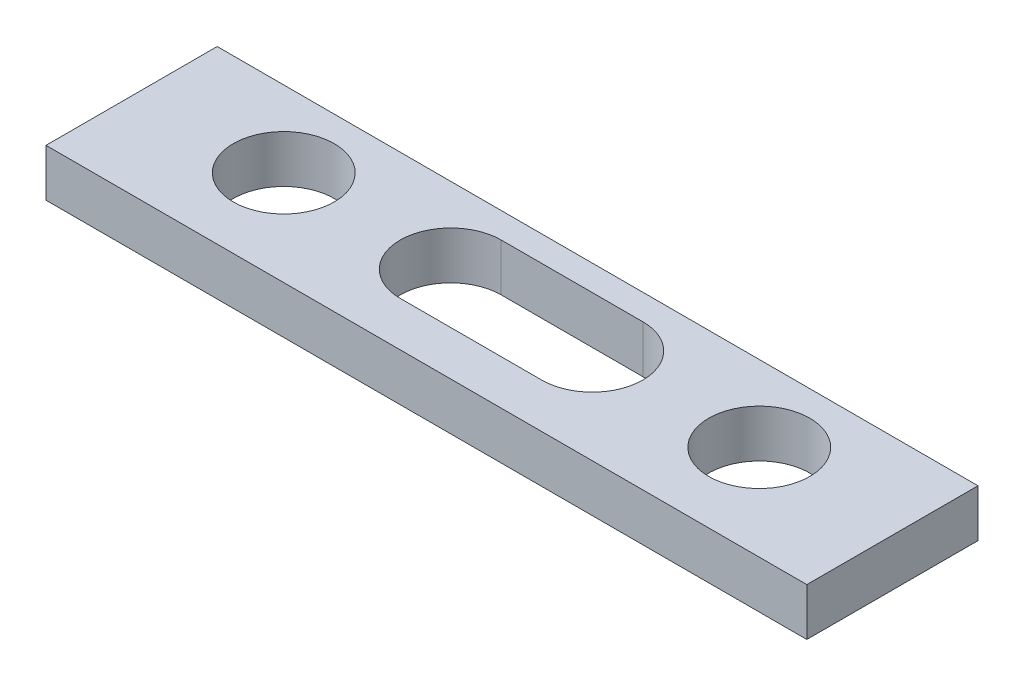
ISO-10303-21;
HEADER;
FILE_DESCRIPTION(('STEP AP214'),'2;1');
FILE_NAME('part.step','',(''),(''),'','','');
FILE_SCHEMA(('AUTOMOTIVE_DESIGN { 1 0 10303 214 1 1 1 1 }'));
ENDSEC;
DATA;
#1=APPLICATION_CONTEXT('core data for automotive mechanical design processes');
#2=APPLICATION_PROTOCOL_DEFINITION('international standard','automotive_design',2000,#1);
#3=PRODUCT_CONTEXT('',#1,'mechanical');
#4=PRODUCT('Part','Part','',(#3));
#5=PRODUCT_RELATED_PRODUCT_CATEGORY('part','',(#4));
#6=PRODUCT_DEFINITION_FORMATION('','',#4);
#7=PRODUCT_DEFINITION_CONTEXT('part definition',#1,'design');
#8=PRODUCT_DEFINITION('design','',#6,#7);
#9=PRODUCT_DEFINITION_SHAPE('','',#8);
#10=(LENGTH_UNIT() NAMED_UNIT(*) SI_UNIT(.MILLI.,.METRE.));
#11=(NAMED_UNIT(*) PLANE_ANGLE_UNIT() SI_UNIT($,.RADIAN.));
#12=(NAMED_UNIT(*) SI_UNIT($,.STERADIAN.) SOLID_ANGLE_UNIT());
#13=UNCERTAINTY_MEASURE_WITH_UNIT(LENGTH_MEASURE(1.E-05),#10,'distance_accuracy_value','');
#14=(GEOMETRIC_REPRESENTATION_CONTEXT(3) GLOBAL_UNCERTAINTY_ASSIGNED_CONTEXT((#13)) GLOBAL_UNIT_ASSIGNED_CONTEXT((#10,
#11,#12)) REPRESENTATION_CONTEXT('',''));
#15=CARTESIAN_POINT('',(0.,0.,0.));
#16=DIRECTION('',(0.,0.,1.));
#17=DIRECTION('',(1.,0.,0.));
#18=AXIS2_PLACEMENT_3D('',#15,#16,#17);
#19=CARTESIAN_POINT('',(50.8,-3.175,-11.43));
#20=DIRECTION('',(0.,0.,1.));
#21=DIRECTION('',(1.,0.,0.));
#22=AXIS2_PLACEMENT_3D('',#19,#20,#21);
#23=PLANE('',#22);
#24=DIRECTION('',(-1.,0.,0.));
#25=VECTOR('',#24,1.);
#26=CARTESIAN_POINT('',(50.8,-3.175,-11.43));
#27=LINE('',#26,#25);
#28=CARTESIAN_POINT('',(50.8,-3.175,-11.43));
#29=VERTEX_POINT('',#28);
#30=CARTESIAN_POINT('',(-50.8,-3.175,-11.43));
#31=VERTEX_POINT('',#30);
#32=EDGE_CURVE('E177',#29,#31,#27,.T.);
#33=ORIENTED_EDGE('',*,*,#32,.T.);
#34=DIRECTION('',(0.,1.,0.));
#35=VECTOR('',#34,1.);
#36=CARTESIAN_POINT('',(-50.8,-3.175,-11.43));
#37=LINE('',#36,#35);
#38=CARTESIAN_POINT('',(-50.8,3.175,-11.43));
#39=VERTEX_POINT('',#38);
#40=EDGE_CURVE('E156',#31,#39,#37,.T.);
#41=ORIENTED_EDGE('',*,*,#40,.T.);
#42=DIRECTION('',(-1.,0.,0.));
#43=VECTOR('',#42,1.);
#44=CARTESIAN_POINT('',(50.8,3.175,-11.43));
#45=LINE('',#44,#43);
#46=CARTESIAN_POINT('',(50.8,3.175,-11.43));
#47=VERTEX_POINT('',#46);
#48=EDGE_CURVE('E13',#47,#39,#45,.T.);
#49=ORIENTED_EDGE('',*,*,#48,.F.);
#50=DIRECTION('',(0.,1.,0.));
#51=VECTOR('',#50,1.);
#52=CARTESIAN_POINT('',(50.8,-3.175,-11.43));
#53=LINE('',#52,#51);
#54=EDGE_CURVE('E168',#29,#47,#53,.T.);
#55=ORIENTED_EDGE('',*,*,#54,.F.);
#56=EDGE_LOOP('',(#33,#41,#49,#55));
#57=FACE_BOUND('',#56,.T.);
#58=ADVANCED_FACE('F45',(#57),#23,.F.);
#59=CARTESIAN_POINT('',(50.8,3.175,11.43));
#60=DIRECTION('',(0.,-1.,0.));
#61=DIRECTION('',(0.,0.,-1.));
#62=AXIS2_PLACEMENT_3D('',#59,#60,#61);
#63=PLANE('',#62);
#64=DIRECTION('',(-1.,0.,0.));
#65=VECTOR('',#64,1.);
#66=CARTESIAN_POINT('',(9.45258988360647,3.175,-8.01687499999999));
#67=LINE('',#66,#65);
#68=CARTESIAN_POINT('',(9.45258988360648,3.175,-8.016875));
#69=VERTEX_POINT('',#68);
#70=CARTESIAN_POINT('',(-9.452589807,3.175,-8.01687499999999));
#71=VERTEX_POINT('',#70);
#72=EDGE_CURVE('E135',#69,#71,#67,.T.);
#73=ORIENTED_EDGE('',*,*,#72,.F.);
#74=CARTESIAN_POINT('',(9.45258988360647,3.175,-1.27));
#75=DIRECTION('',(0.,1.,0.));
#76=DIRECTION('',(0.,0.,1.));
#77=AXIS2_PLACEMENT_3D('',#74,#75,#76);
#78=CIRCLE('',#77,6.74687499999999);
#79=CARTESIAN_POINT('',(9.45258988360647,3.175,5.47687499999999));
#80=VERTEX_POINT('',#79);
#81=EDGE_CURVE('E59',#80,#69,#78,.T.);
#82=ORIENTED_EDGE('',*,*,#81,.F.);
#83=DIRECTION('',(1.,0.,0.));
#84=VECTOR('',#83,1.);
#85=CARTESIAN_POINT('',(9.45258988360647,3.175,5.47687499999999));
#86=LINE('',#85,#84);
#87=CARTESIAN_POINT('',(-9.452589807,3.175,5.47687499999999));
#88=VERTEX_POINT('',#87);
#89=EDGE_CURVE('E126',#88,#80,#86,.T.);
#90=ORIENTED_EDGE('',*,*,#89,.F.);
#91=CARTESIAN_POINT('',(-9.452589807,3.175,-1.27));
#92=DIRECTION('',(0.,1.,0.));
#93=DIRECTION('',(0.,0.,1.));
#94=AXIS2_PLACEMENT_3D('',#91,#92,#93);
#95=CIRCLE('',#94,6.74687499999999);
#96=EDGE_CURVE('E129',#71,#88,#95,.T.);
#97=ORIENTED_EDGE('',*,*,#96,.F.);
#98=EDGE_LOOP('',(#73,#82,#90,#97));
#99=FACE_BOUND('',#98,.T.);
#100=CARTESIAN_POINT('',(-31.75,3.175,-1.27));
#101=DIRECTION('',(0.,1.,0.));
#102=DIRECTION('',(0.,0.,1.));
#103=AXIS2_PLACEMENT_3D('',#100,#101,#102);
#104=CIRCLE('',#103,6.74623999999999);
#105=CARTESIAN_POINT('',(-31.75,3.175,5.47623999999999));
#106=VERTEX_POINT('',#105);
#107=EDGE_CURVE('E141',#106,#106,#104,.T.);
#108=ORIENTED_EDGE('',*,*,#107,.F.);
#109=EDGE_LOOP('',(#108));
#110=FACE_BOUND('',#109,.T.);
#111=CARTESIAN_POINT('',(31.75,3.175,-1.27));
#112=DIRECTION('',(0.,1.,0.));
#113=DIRECTION('',(0.,0.,1.));
#114=AXIS2_PLACEMENT_3D('',#111,#112,#113);
#115=CIRCLE('',#114,6.74623999999999);
#116=CARTESIAN_POINT('',(31.75,3.175,5.47623999999999));
#117=VERTEX_POINT('',#116);
#118=EDGE_CURVE('E150',#117,#117,#115,.T.);
#119=ORIENTED_EDGE('',*,*,#118,.F.);
#120=EDGE_LOOP('',(#119));
#121=FACE_BOUND('',#120,.T.);
#122=ORIENTED_EDGE('',*,*,#48,.T.);
#123=DIRECTION('',(0.,0.,1.));
#124=VECTOR('',#123,1.);
#125=CARTESIAN_POINT('',(-50.8,3.175,11.43));
#126=LINE('',#125,#124);
#127=CARTESIAN_POINT('',(-50.8,3.175,11.43));
#128=VERTEX_POINT('',#127);
#129=EDGE_CURVE('E159',#39,#128,#126,.T.);
#130=ORIENTED_EDGE('',*,*,#129,.T.);
#131=DIRECTION('',(-1.,0.,0.));
#132=VECTOR('',#131,1.);
#133=CARTESIAN_POINT('',(50.8,3.175,11.43));
#134=LINE('',#133,#132);
#135=CARTESIAN_POINT('',(50.8,3.175,11.43));
#136=VERTEX_POINT('',#135);
#137=EDGE_CURVE('E52',#136,#128,#134,.T.);
#138=ORIENTED_EDGE('',*,*,#137,.F.);
#139=DIRECTION('',(0.,0.,1.));
#140=VECTOR('',#139,1.);
#141=CARTESIAN_POINT('',(50.8,3.175,11.43));
#142=LINE('',#141,#140);
#143=EDGE_CURVE('E171',#47,#136,#142,.T.);
#144=ORIENTED_EDGE('',*,*,#143,.F.);
#145=EDGE_LOOP('',(#122,#130,#138,#144));
#146=FACE_BOUND('',#145,.T.);
#147=ADVANCED_FACE('F192',(#99,#110,#121,#146),#63,.F.);
#148=CARTESIAN_POINT('',(50.8,-3.175,11.43));
#149=DIRECTION('',(0.,0.,-1.));
#150=DIRECTION('',(0.,1.,0.));
#151=AXIS2_PLACEMENT_3D('',#148,#149,#150);
#152=PLANE('',#151);
#153=ORIENTED_EDGE('',*,*,#137,.T.);
#154=DIRECTION('',(0.,-1.,0.));
#155=VECTOR('',#154,1.);
#156=CARTESIAN_POINT('',(-50.8,-3.175,11.43));
#157=LINE('',#156,#155);
#158=CARTESIAN_POINT('',(-50.8,-3.175,11.43));
#159=VERTEX_POINT('',#158);
#160=EDGE_CURVE('E162',#128,#159,#157,.T.);
#161=ORIENTED_EDGE('',*,*,#160,.T.);
#162=DIRECTION('',(-1.,0.,0.));
#163=VECTOR('',#162,1.);
#164=CARTESIAN_POINT('',(50.8,-3.175,11.43));
#165=LINE('',#164,#163);
#166=CARTESIAN_POINT('',(50.8,-3.175,11.43));
#167=VERTEX_POINT('',#166);
#168=EDGE_CURVE('E179',#167,#159,#165,.T.);
#169=ORIENTED_EDGE('',*,*,#168,.F.);
#170=DIRECTION('',(0.,-1.,0.));
#171=VECTOR('',#170,1.);
#172=CARTESIAN_POINT('',(50.8,-3.175,11.43));
#173=LINE('',#172,#171);
#174=EDGE_CURVE('E173',#136,#167,#173,.T.);
#175=ORIENTED_EDGE('',*,*,#174,.F.);
#176=EDGE_LOOP('',(#153,#161,#169,#175));
#177=FACE_BOUND('',#176,.T.);
#178=ADVANCED_FACE('F184',(#177),#152,.F.);
#179=CARTESIAN_POINT('',(50.8,-3.175,11.43));
#180=DIRECTION('',(0.,1.,0.));
#181=DIRECTION('',(0.,0.,1.));
#182=AXIS2_PLACEMENT_3D('',#179,#180,#181);
#183=PLANE('',#182);
#184=DIRECTION('',(1.,0.,0.));
#185=VECTOR('',#184,1.);
#186=CARTESIAN_POINT('',(9.45258988360647,-3.175,5.47687499999999));
#187=LINE('',#186,#185);
#188=CARTESIAN_POINT('',(-9.452589807,-3.175,5.47687499999999));
#189=VERTEX_POINT('',#188);
#190=CARTESIAN_POINT('',(9.45258988360647,-3.175,5.47687499999999));
#191=VERTEX_POINT('',#190);
#192=EDGE_CURVE('E116',#189,#191,#187,.T.);
#193=ORIENTED_EDGE('',*,*,#192,.T.);
#194=CARTESIAN_POINT('',(9.45258988360647,-3.175,-1.27));
#195=DIRECTION('',(0.,1.,0.));
#196=DIRECTION('',(0.,0.,1.));
#197=AXIS2_PLACEMENT_3D('',#194,#195,#196);
#198=CIRCLE('',#197,6.74687499999999);
#199=CARTESIAN_POINT('',(9.45258988360647,-3.175,-8.016875));
#200=VERTEX_POINT('',#199);
#201=EDGE_CURVE('E110',#191,#200,#198,.T.);
#202=ORIENTED_EDGE('',*,*,#201,.T.);
#203=DIRECTION('',(-1.,0.,0.));
#204=VECTOR('',#203,1.);
#205=CARTESIAN_POINT('',(9.45258988360647,-3.175,-8.016875));
#206=LINE('',#205,#204);
#207=CARTESIAN_POINT('',(-9.45258980699999,-3.175,-8.016875));
#208=VERTEX_POINT('',#207);
#209=EDGE_CURVE('E119',#200,#208,#206,.T.);
#210=ORIENTED_EDGE('',*,*,#209,.T.);
#211=CARTESIAN_POINT('',(-9.452589807,-3.175,-1.27));
#212=DIRECTION('',(0.,1.,0.));
#213=DIRECTION('',(0.,0.,1.));
#214=AXIS2_PLACEMENT_3D('',#211,#212,#213);
#215=CIRCLE('',#214,6.74687499999999);
#216=EDGE_CURVE('E67',#208,#189,#215,.T.);
#217=ORIENTED_EDGE('',*,*,#216,.T.);
#218=EDGE_LOOP('',(#193,#202,#210,#217));
#219=FACE_BOUND('',#218,.T.);
#220=CARTESIAN_POINT('',(-31.75,-3.175,-1.27));
#221=DIRECTION('',(0.,1.,0.));
#222=DIRECTION('',(0.,0.,1.));
#223=AXIS2_PLACEMENT_3D('',#220,#221,#222);
#224=CIRCLE('',#223,6.74623999999999);
#225=CARTESIAN_POINT('',(-31.75,-3.175,5.47623999999999));
#226=VERTEX_POINT('',#225);
#227=EDGE_CURVE('E147',#226,#226,#224,.T.);
#228=ORIENTED_EDGE('',*,*,#227,.T.);
#229=EDGE_LOOP('',(#228));
#230=FACE_BOUND('',#229,.T.);
#231=CARTESIAN_POINT('',(31.75,-3.175,-1.27));
#232=DIRECTION('',(0.,1.,0.));
#233=DIRECTION('',(0.,0.,1.));
#234=AXIS2_PLACEMENT_3D('',#231,#232,#233);
#235=CIRCLE('',#234,6.74623999999999);
#236=CARTESIAN_POINT('',(31.75,-3.175,5.47623999999999));
#237=VERTEX_POINT('',#236);
#238=EDGE_CURVE('E153',#237,#237,#235,.T.);
#239=ORIENTED_EDGE('',*,*,#238,.T.);
#240=EDGE_LOOP('',(#239));
#241=FACE_BOUND('',#240,.T.);
#242=ORIENTED_EDGE('',*,*,#168,.T.);
#243=DIRECTION('',(0.,0.,-1.));
#244=VECTOR('',#243,1.);
#245=CARTESIAN_POINT('',(-50.8,-3.175,11.43));
#246=LINE('',#245,#244);
#247=EDGE_CURVE('E165',#159,#31,#246,.T.);
#248=ORIENTED_EDGE('',*,*,#247,.T.);
#249=ORIENTED_EDGE('',*,*,#32,.F.);
#250=DIRECTION('',(0.,0.,-1.));
#251=VECTOR('',#250,1.);
#252=CARTESIAN_POINT('',(50.8,-3.175,11.43));
#253=LINE('',#252,#251);
#254=EDGE_CURVE('E175',#167,#29,#253,.T.);
#255=ORIENTED_EDGE('',*,*,#254,.F.);
#256=EDGE_LOOP('',(#242,#248,#249,#255));
#257=FACE_BOUND('',#256,.T.);
#258=ADVANCED_FACE('F123',(#219,#230,#241,#257),#183,.F.);
#259=CARTESIAN_POINT('',(50.8,3.175,-11.43));
#260=DIRECTION('',(-1.,0.,0.));
#261=DIRECTION('',(0.,0.,1.));
#262=AXIS2_PLACEMENT_3D('',#259,#260,#261);
#263=PLANE('',#262);
#264=ORIENTED_EDGE('',*,*,#54,.T.);
#265=ORIENTED_EDGE('',*,*,#143,.T.);
#266=ORIENTED_EDGE('',*,*,#174,.T.);
#267=ORIENTED_EDGE('',*,*,#254,.T.);
#268=EDGE_LOOP('',(#264,#265,#266,#267));
#269=FACE_BOUND('',#268,.T.);
#270=ADVANCED_FACE('F200',(#269),#263,.F.);
#271=CARTESIAN_POINT('',(-50.8,3.175,-11.43));
#272=DIRECTION('',(-1.,0.,0.));
#273=DIRECTION('',(0.,0.,1.));
#274=AXIS2_PLACEMENT_3D('',#271,#272,#273);
#275=PLANE('',#274);
#276=ORIENTED_EDGE('',*,*,#40,.F.);
#277=ORIENTED_EDGE('',*,*,#247,.F.);
#278=ORIENTED_EDGE('',*,*,#160,.F.);
#279=ORIENTED_EDGE('',*,*,#129,.F.);
#280=EDGE_LOOP('',(#276,#277,#278,#279));
#281=FACE_BOUND('',#280,.T.);
#282=ADVANCED_FACE('F191',(#281),#275,.T.);
#283=CARTESIAN_POINT('',(31.75,3.175,-1.27));
#284=DIRECTION('',(0.,1.,0.));
#285=DIRECTION('',(0.,0.,1.));
#286=AXIS2_PLACEMENT_3D('',#283,#284,#285);
#287=CYLINDRICAL_SURFACE('',#286,6.74623999999999);
#288=ORIENTED_EDGE('',*,*,#238,.F.);
#289=EDGE_LOOP('',(#288));
#290=FACE_BOUND('',#289,.T.);
#291=ORIENTED_EDGE('',*,*,#118,.T.);
#292=EDGE_LOOP('',(#291));
#293=FACE_BOUND('',#292,.T.);
#294=ADVANCED_FACE('F207',(#290,#293),#287,.F.);
#295=CARTESIAN_POINT('',(-31.75,3.175,-1.27));
#296=DIRECTION('',(0.,1.,0.));
#297=DIRECTION('',(0.,0.,1.));
#298=AXIS2_PLACEMENT_3D('',#295,#296,#297);
#299=CYLINDRICAL_SURFACE('',#298,6.74623999999999);
#300=ORIENTED_EDGE('',*,*,#227,.F.);
#301=EDGE_LOOP('',(#300));
#302=FACE_BOUND('',#301,.T.);
#303=ORIENTED_EDGE('',*,*,#107,.T.);
#304=EDGE_LOOP('',(#303));
#305=FACE_BOUND('',#304,.T.);
#306=ADVANCED_FACE('F226',(#302,#305),#299,.F.);
#307=CARTESIAN_POINT('',(9.45258988360647,-3.175,-1.27));
#308=DIRECTION('',(0.,1.,0.));
#309=DIRECTION('',(0.,0.,1.));
#310=AXIS2_PLACEMENT_3D('',#307,#308,#309);
#311=CYLINDRICAL_SURFACE('',#310,6.74687499999999);
#312=ORIENTED_EDGE('',*,*,#81,.T.);
#313=DIRECTION('',(0.,1.,0.));
#314=VECTOR('',#313,1.);
#315=CARTESIAN_POINT('',(9.45258988360647,-3.175,-8.016875));
#316=LINE('',#315,#314);
#317=EDGE_CURVE('E106',#200,#69,#316,.T.);
#318=ORIENTED_EDGE('',*,*,#317,.F.);
#319=ORIENTED_EDGE('',*,*,#201,.F.);
#320=DIRECTION('',(0.,1.,0.));
#321=VECTOR('',#320,1.);
#322=CARTESIAN_POINT('',(9.45258988360647,-3.175,5.47687499999999));
#323=LINE('',#322,#321);
#324=EDGE_CURVE('E139',#191,#80,#323,.T.);
#325=ORIENTED_EDGE('',*,*,#324,.T.);
#326=EDGE_LOOP('',(#312,#318,#319,#325));
#327=FACE_BOUND('',#326,.T.);
#328=ADVANCED_FACE('F108',(#327),#311,.F.);
#329=CARTESIAN_POINT('',(9.45258988360647,-3.175,5.47687499999999));
#330=DIRECTION('',(0.,0.,1.));
#331=DIRECTION('',(0.,-1.,0.));
#332=AXIS2_PLACEMENT_3D('',#329,#330,#331);
#333=PLANE('',#332);
#334=ORIENTED_EDGE('',*,*,#89,.T.);
#335=ORIENTED_EDGE('',*,*,#324,.F.);
#336=ORIENTED_EDGE('',*,*,#192,.F.);
#337=DIRECTION('',(0.,1.,0.));
#338=VECTOR('',#337,1.);
#339=CARTESIAN_POINT('',(-9.452589807,-3.175,5.47687499999999));
#340=LINE('',#339,#338);
#341=EDGE_CURVE('E142',#189,#88,#340,.T.);
#342=ORIENTED_EDGE('',*,*,#341,.T.);
#343=EDGE_LOOP('',(#334,#335,#336,#342));
#344=FACE_BOUND('',#343,.T.);
#345=ADVANCED_FACE('F238',(#344),#333,.F.);
#346=CARTESIAN_POINT('',(-9.452589807,-3.175,-1.27));
#347=DIRECTION('',(0.,1.,0.));
#348=DIRECTION('',(0.,0.,1.));
#349=AXIS2_PLACEMENT_3D('',#346,#347,#348);
#350=CYLINDRICAL_SURFACE('',#349,6.74687499999999);
#351=ORIENTED_EDGE('',*,*,#96,.T.);
#352=ORIENTED_EDGE('',*,*,#341,.F.);
#353=ORIENTED_EDGE('',*,*,#216,.F.);
#354=DIRECTION('',(0.,1.,0.));
#355=VECTOR('',#354,1.);
#356=CARTESIAN_POINT('',(-9.452589807,-3.175,-8.016875));
#357=LINE('',#356,#355);
#358=EDGE_CURVE('E115',#208,#71,#357,.T.);
#359=ORIENTED_EDGE('',*,*,#358,.T.);
#360=EDGE_LOOP('',(#351,#352,#353,#359));
#361=FACE_BOUND('',#360,.T.);
#362=ADVANCED_FACE('F241',(#361),#350,.F.);
#363=CARTESIAN_POINT('',(9.45258988360647,-3.175,-8.016875));
#364=DIRECTION('',(0.,0.,-1.));
#365=DIRECTION('',(0.,1.,0.));
#366=AXIS2_PLACEMENT_3D('',#363,#364,#365);
#367=PLANE('',#366);
#368=ORIENTED_EDGE('',*,*,#72,.T.);
#369=ORIENTED_EDGE('',*,*,#358,.F.);
#370=ORIENTED_EDGE('',*,*,#209,.F.);
#371=ORIENTED_EDGE('',*,*,#317,.T.);
#372=EDGE_LOOP('',(#368,#369,#370,#371));
#373=FACE_BOUND('',#372,.T.);
#374=ADVANCED_FACE('F120',(#373),#367,.F.);
#375=CLOSED_SHELL('',(#58,#147,#178,#258,#270,#282,#294,#306,#328,#345,#362,#374));
#376=MANIFOLD_SOLID_BREP('B2',#375);
#377=ADVANCED_BREP_SHAPE_REPRESENTATION('',(#18,#376),#14);
#378=SHAPE_DEFINITION_REPRESENTATION(#9,#377);
ENDSEC;
END-ISO-10303-21;
